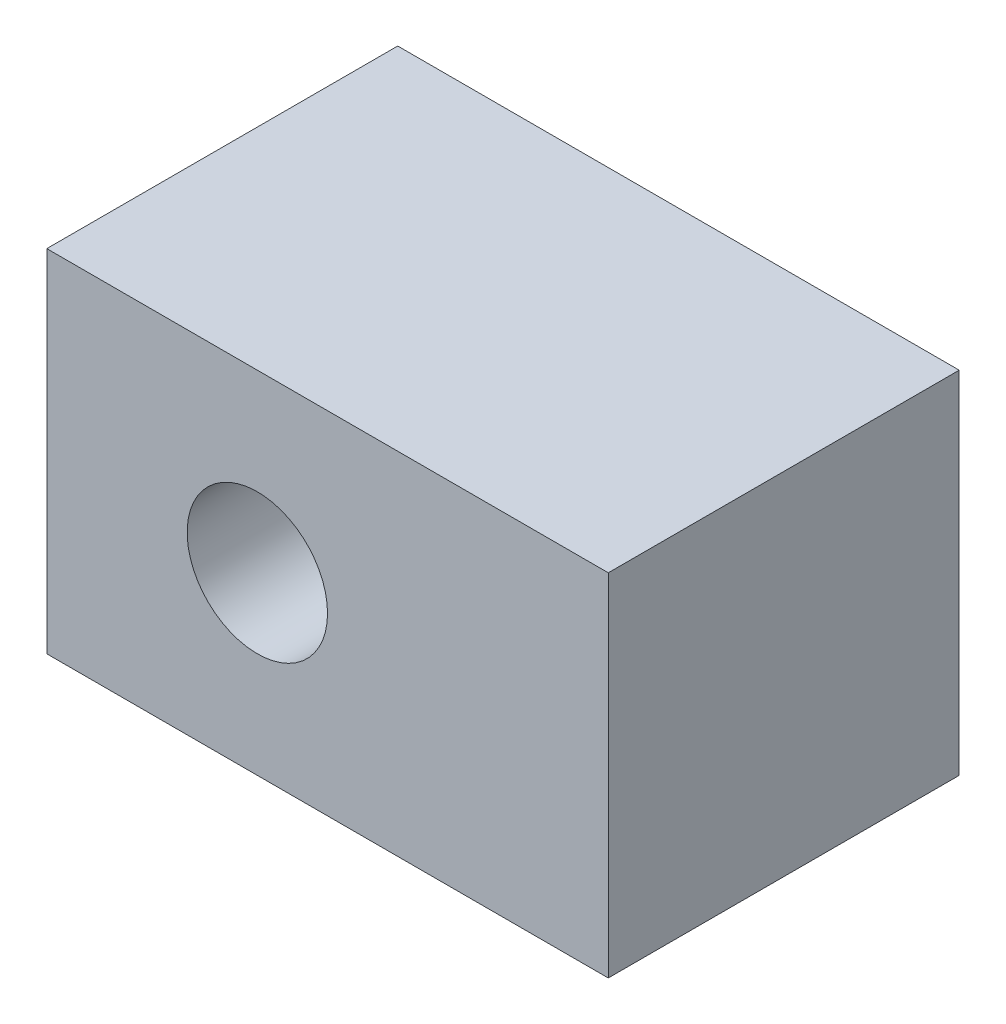
ISO-10303-21;
HEADER;
FILE_DESCRIPTION(('STEP AP214'),'2;1');
FILE_NAME('part.step','',(''),(''),'','','');
FILE_SCHEMA(('AUTOMOTIVE_DESIGN { 1 0 10303 214 1 1 1 1 }'));
ENDSEC;
DATA;
#1=APPLICATION_CONTEXT('core data for automotive mechanical design processes');
#2=APPLICATION_PROTOCOL_DEFINITION('international standard','automotive_design',2000,#1);
#3=PRODUCT_CONTEXT('',#1,'mechanical');
#4=PRODUCT('Part','Part','',(#3));
#5=PRODUCT_RELATED_PRODUCT_CATEGORY('part','',(#4));
#6=PRODUCT_DEFINITION_FORMATION('','',#4);
#7=PRODUCT_DEFINITION_CONTEXT('part definition',#1,'design');
#8=PRODUCT_DEFINITION('design','',#6,#7);
#9=PRODUCT_DEFINITION_SHAPE('','',#8);
#10=(LENGTH_UNIT() NAMED_UNIT(*) SI_UNIT(.MILLI.,.METRE.));
#11=(NAMED_UNIT(*) PLANE_ANGLE_UNIT() SI_UNIT($,.RADIAN.));
#12=(NAMED_UNIT(*) SI_UNIT($,.STERADIAN.) SOLID_ANGLE_UNIT());
#13=UNCERTAINTY_MEASURE_WITH_UNIT(LENGTH_MEASURE(1.E-05),#10,'distance_accuracy_value','');
#14=(GEOMETRIC_REPRESENTATION_CONTEXT(3) GLOBAL_UNCERTAINTY_ASSIGNED_CONTEXT((#13)) GLOBAL_UNIT_ASSIGNED_CONTEXT((#10,
#11,#12)) REPRESENTATION_CONTEXT('',''));
#15=CARTESIAN_POINT('',(0.,0.,0.));
#16=DIRECTION('',(0.,0.,1.));
#17=DIRECTION('',(1.,0.,0.));
#18=AXIS2_PLACEMENT_3D('',#15,#16,#17);
#19=CARTESIAN_POINT('',(0.,0.,25.));
#20=DIRECTION('',(0.,0.,1.));
#21=DIRECTION('',(1.,0.,0.));
#22=AXIS2_PLACEMENT_3D('',#19,#20,#21);
#23=PLANE('',#22);
#24=DIRECTION('',(0.,-1.,0.));
#25=VECTOR('',#24,1.);
#26=CARTESIAN_POINT('',(-30.,25.,25.));
#27=LINE('',#26,#25);
#28=CARTESIAN_POINT('',(-30.,25.,25.));
#29=VERTEX_POINT('',#28);
#30=CARTESIAN_POINT('',(-30.,-25.,25.));
#31=VERTEX_POINT('',#30);
#32=EDGE_CURVE('E87',#29,#31,#27,.T.);
#33=ORIENTED_EDGE('',*,*,#32,.T.);
#34=DIRECTION('',(1.,0.,0.));
#35=VECTOR('',#34,1.);
#36=CARTESIAN_POINT('',(-30.,-25.,25.));
#37=LINE('',#36,#35);
#38=CARTESIAN_POINT('',(50.,-25.,25.));
#39=VERTEX_POINT('',#38);
#40=EDGE_CURVE('E82',#31,#39,#37,.T.);
#41=ORIENTED_EDGE('',*,*,#40,.T.);
#42=DIRECTION('',(0.,1.,0.));
#43=VECTOR('',#42,1.);
#44=CARTESIAN_POINT('',(50.,25.,25.));
#45=LINE('',#44,#43);
#46=CARTESIAN_POINT('',(50.,25.,25.));
#47=VERTEX_POINT('',#46);
#48=EDGE_CURVE('E85',#39,#47,#45,.T.);
#49=ORIENTED_EDGE('',*,*,#48,.T.);
#50=DIRECTION('',(-1.,0.,0.));
#51=VECTOR('',#50,1.);
#52=CARTESIAN_POINT('',(-30.,25.,25.));
#53=LINE('',#52,#51);
#54=EDGE_CURVE('E52',#47,#29,#53,.T.);
#55=ORIENTED_EDGE('',*,*,#54,.T.);
#56=EDGE_LOOP('',(#33,#41,#49,#55));
#57=FACE_BOUND('',#56,.T.);
#58=CARTESIAN_POINT('',(0.,0.,25.));
#59=DIRECTION('',(0.,0.,1.));
#60=DIRECTION('',(1.,0.,0.));
#61=AXIS2_PLACEMENT_3D('',#58,#59,#60);
#62=CIRCLE('',#61,10.);
#63=CARTESIAN_POINT('',(10.,0.,25.));
#64=VERTEX_POINT('',#63);
#65=EDGE_CURVE('E102',#64,#64,#62,.T.);
#66=ORIENTED_EDGE('',*,*,#65,.F.);
#67=EDGE_LOOP('',(#66));
#68=FACE_BOUND('',#67,.T.);
#69=ADVANCED_FACE('F35',(#57,#68),#23,.T.);
#70=CARTESIAN_POINT('',(0.,0.,-25.));
#71=DIRECTION('',(0.,0.,1.));
#72=DIRECTION('',(1.,0.,0.));
#73=AXIS2_PLACEMENT_3D('',#70,#71,#72);
#74=PLANE('',#73);
#75=DIRECTION('',(0.,-1.,0.));
#76=VECTOR('',#75,1.);
#77=CARTESIAN_POINT('',(-30.,25.,-25.));
#78=LINE('',#77,#76);
#79=CARTESIAN_POINT('',(-30.,25.,-25.));
#80=VERTEX_POINT('',#79);
#81=CARTESIAN_POINT('',(-30.,-25.,-25.));
#82=VERTEX_POINT('',#81);
#83=EDGE_CURVE('E99',#80,#82,#78,.T.);
#84=ORIENTED_EDGE('',*,*,#83,.F.);
#85=DIRECTION('',(-1.,0.,0.));
#86=VECTOR('',#85,1.);
#87=CARTESIAN_POINT('',(-30.,25.,-25.));
#88=LINE('',#87,#86);
#89=CARTESIAN_POINT('',(50.,25.,-25.));
#90=VERTEX_POINT('',#89);
#91=EDGE_CURVE('E75',#90,#80,#88,.T.);
#92=ORIENTED_EDGE('',*,*,#91,.F.);
#93=DIRECTION('',(0.,1.,0.));
#94=VECTOR('',#93,1.);
#95=CARTESIAN_POINT('',(50.,25.,-25.));
#96=LINE('',#95,#94);
#97=CARTESIAN_POINT('',(50.,-25.,-25.));
#98=VERTEX_POINT('',#97);
#99=EDGE_CURVE('E69',#98,#90,#96,.T.);
#100=ORIENTED_EDGE('',*,*,#99,.F.);
#101=DIRECTION('',(1.,0.,0.));
#102=VECTOR('',#101,1.);
#103=CARTESIAN_POINT('',(-30.,-25.,-25.));
#104=LINE('',#103,#102);
#105=EDGE_CURVE('E91',#82,#98,#104,.T.);
#106=ORIENTED_EDGE('',*,*,#105,.F.);
#107=EDGE_LOOP('',(#84,#92,#100,#106));
#108=FACE_BOUND('',#107,.T.);
#109=CARTESIAN_POINT('',(0.,0.,-25.));
#110=DIRECTION('',(0.,0.,1.));
#111=DIRECTION('',(1.,0.,0.));
#112=AXIS2_PLACEMENT_3D('',#109,#110,#111);
#113=CIRCLE('',#112,10.);
#114=CARTESIAN_POINT('',(10.,0.,-25.));
#115=VERTEX_POINT('',#114);
#116=EDGE_CURVE('E114',#115,#115,#113,.T.);
#117=ORIENTED_EDGE('',*,*,#116,.T.);
#118=EDGE_LOOP('',(#117));
#119=FACE_BOUND('',#118,.T.);
#120=ADVANCED_FACE('F110',(#108,#119),#74,.F.);
#121=CARTESIAN_POINT('',(-30.,25.,25.));
#122=DIRECTION('',(1.,0.,0.));
#123=DIRECTION('',(0.,0.,-1.));
#124=AXIS2_PLACEMENT_3D('',#121,#122,#123);
#125=PLANE('',#124);
#126=ORIENTED_EDGE('',*,*,#83,.T.);
#127=DIRECTION('',(0.,0.,-1.));
#128=VECTOR('',#127,1.);
#129=CARTESIAN_POINT('',(-30.,-25.,25.));
#130=LINE('',#129,#128);
#131=EDGE_CURVE('E11',#31,#82,#130,.T.);
#132=ORIENTED_EDGE('',*,*,#131,.F.);
#133=ORIENTED_EDGE('',*,*,#32,.F.);
#134=DIRECTION('',(0.,0.,-1.));
#135=VECTOR('',#134,1.);
#136=CARTESIAN_POINT('',(-30.,25.,25.));
#137=LINE('',#136,#135);
#138=EDGE_CURVE('E95',#29,#80,#137,.T.);
#139=ORIENTED_EDGE('',*,*,#138,.T.);
#140=EDGE_LOOP('',(#126,#132,#133,#139));
#141=FACE_BOUND('',#140,.T.);
#142=ADVANCED_FACE('F37',(#141),#125,.F.);
#143=CARTESIAN_POINT('',(-30.,-25.,25.));
#144=DIRECTION('',(0.,1.,0.));
#145=DIRECTION('',(0.,0.,1.));
#146=AXIS2_PLACEMENT_3D('',#143,#144,#145);
#147=PLANE('',#146);
#148=ORIENTED_EDGE('',*,*,#105,.T.);
#149=DIRECTION('',(0.,0.,-1.));
#150=VECTOR('',#149,1.);
#151=CARTESIAN_POINT('',(50.,-25.,25.));
#152=LINE('',#151,#150);
#153=EDGE_CURVE('E44',#39,#98,#152,.T.);
#154=ORIENTED_EDGE('',*,*,#153,.F.);
#155=ORIENTED_EDGE('',*,*,#40,.F.);
#156=ORIENTED_EDGE('',*,*,#131,.T.);
#157=EDGE_LOOP('',(#148,#154,#155,#156));
#158=FACE_BOUND('',#157,.T.);
#159=ADVANCED_FACE('F90',(#158),#147,.F.);
#160=CARTESIAN_POINT('',(50.,25.,25.));
#161=DIRECTION('',(-1.,0.,0.));
#162=DIRECTION('',(0.,0.,1.));
#163=AXIS2_PLACEMENT_3D('',#160,#161,#162);
#164=PLANE('',#163);
#165=ORIENTED_EDGE('',*,*,#99,.T.);
#166=DIRECTION('',(0.,0.,-1.));
#167=VECTOR('',#166,1.);
#168=CARTESIAN_POINT('',(50.,25.,25.));
#169=LINE('',#168,#167);
#170=EDGE_CURVE('E92',#47,#90,#169,.T.);
#171=ORIENTED_EDGE('',*,*,#170,.F.);
#172=ORIENTED_EDGE('',*,*,#48,.F.);
#173=ORIENTED_EDGE('',*,*,#153,.T.);
#174=EDGE_LOOP('',(#165,#171,#172,#173));
#175=FACE_BOUND('',#174,.T.);
#176=ADVANCED_FACE('F93',(#175),#164,.F.);
#177=CARTESIAN_POINT('',(-30.,25.,25.));
#178=DIRECTION('',(0.,-1.,0.));
#179=DIRECTION('',(0.,0.,-1.));
#180=AXIS2_PLACEMENT_3D('',#177,#178,#179);
#181=PLANE('',#180);
#182=ORIENTED_EDGE('',*,*,#91,.T.);
#183=ORIENTED_EDGE('',*,*,#138,.F.);
#184=ORIENTED_EDGE('',*,*,#54,.F.);
#185=ORIENTED_EDGE('',*,*,#170,.T.);
#186=EDGE_LOOP('',(#182,#183,#184,#185));
#187=FACE_BOUND('',#186,.T.);
#188=ADVANCED_FACE('F107',(#187),#181,.F.);
#189=CARTESIAN_POINT('',(0.,0.,25.));
#190=DIRECTION('',(0.,0.,-1.));
#191=DIRECTION('',(-1.,0.,0.));
#192=AXIS2_PLACEMENT_3D('',#189,#190,#191);
#193=CYLINDRICAL_SURFACE('',#192,10.);
#194=ORIENTED_EDGE('',*,*,#65,.T.);
#195=EDGE_LOOP('',(#194));
#196=FACE_BOUND('',#195,.T.);
#197=ORIENTED_EDGE('',*,*,#116,.F.);
#198=EDGE_LOOP('',(#197));
#199=FACE_BOUND('',#198,.T.);
#200=ADVANCED_FACE('F120',(#196,#199),#193,.F.);
#201=CLOSED_SHELL('',(#69,#120,#142,#159,#176,#188,#200));
#202=MANIFOLD_SOLID_BREP('B2',#201);
#203=ADVANCED_BREP_SHAPE_REPRESENTATION('',(#18,#202),#14);
#204=SHAPE_DEFINITION_REPRESENTATION(#9,#203);
ENDSEC;
END-ISO-10303-21;
